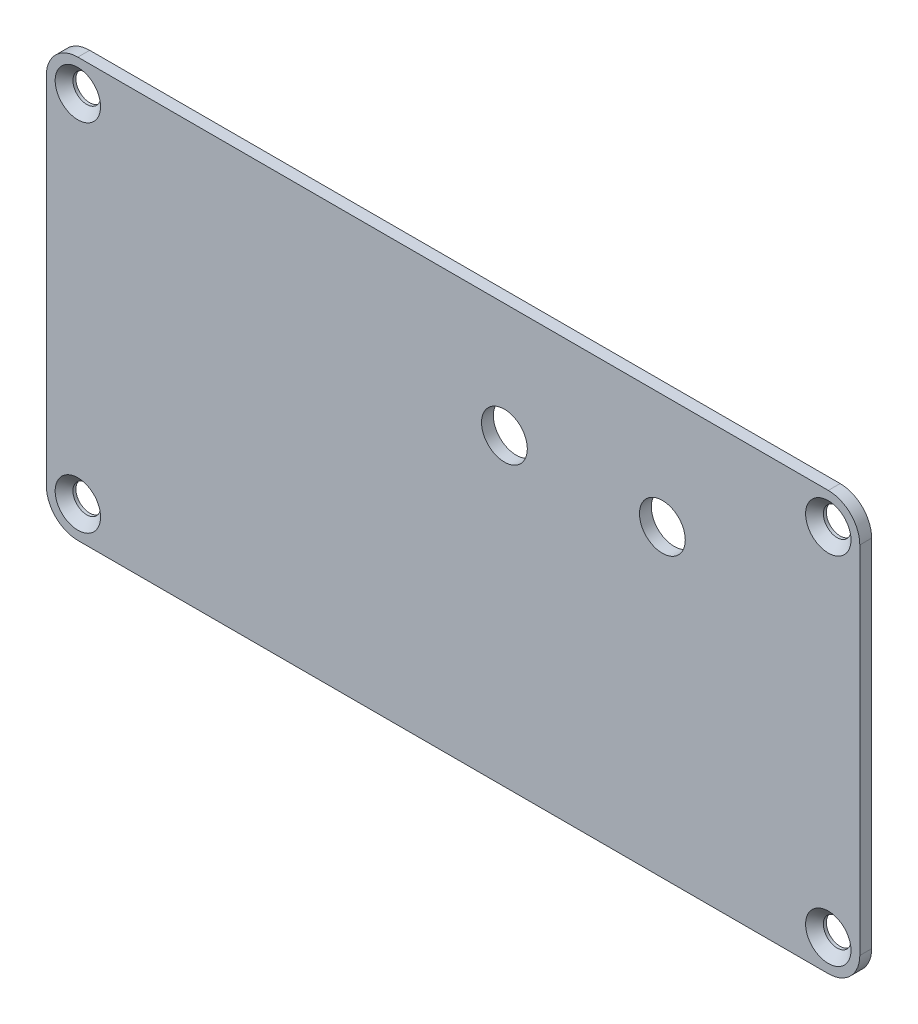
ISO-10303-21;
HEADER;
FILE_DESCRIPTION(('STEP AP214'),'2;1');
FILE_NAME('part.step','',(''),(''),'','','');
FILE_SCHEMA(('AUTOMOTIVE_DESIGN { 1 0 10303 214 1 1 1 1 }'));
ENDSEC;
DATA;
#1=APPLICATION_CONTEXT('core data for automotive mechanical design processes');
#2=APPLICATION_PROTOCOL_DEFINITION('international standard','automotive_design',2000,#1);
#3=PRODUCT_CONTEXT('',#1,'mechanical');
#4=PRODUCT('Part','Part','',(#3));
#5=PRODUCT_RELATED_PRODUCT_CATEGORY('part','',(#4));
#6=PRODUCT_DEFINITION_FORMATION('','',#4);
#7=PRODUCT_DEFINITION_CONTEXT('part definition',#1,'design');
#8=PRODUCT_DEFINITION('design','',#6,#7);
#9=PRODUCT_DEFINITION_SHAPE('','',#8);
#10=(LENGTH_UNIT() NAMED_UNIT(*) SI_UNIT(.MILLI.,.METRE.));
#11=(NAMED_UNIT(*) PLANE_ANGLE_UNIT() SI_UNIT($,.RADIAN.));
#12=(NAMED_UNIT(*) SI_UNIT($,.STERADIAN.) SOLID_ANGLE_UNIT());
#13=UNCERTAINTY_MEASURE_WITH_UNIT(LENGTH_MEASURE(1.E-05),#10,'distance_accuracy_value','');
#14=(GEOMETRIC_REPRESENTATION_CONTEXT(3) GLOBAL_UNCERTAINTY_ASSIGNED_CONTEXT((#13)) GLOBAL_UNIT_ASSIGNED_CONTEXT((#10,
#11,#12)) REPRESENTATION_CONTEXT('',''));
#15=CARTESIAN_POINT('',(0.,0.,0.));
#16=DIRECTION('',(0.,0.,1.));
#17=DIRECTION('',(1.,0.,0.));
#18=AXIS2_PLACEMENT_3D('',#15,#16,#17);
#19=CARTESIAN_POINT('',(51.5,26.5,0.750000000000008));
#20=DIRECTION('',(1.,0.,0.));
#21=DIRECTION('',(0.,0.,-1.));
#22=AXIS2_PLACEMENT_3D('',#19,#20,#21);
#23=PLANE('',#22);
#24=DIRECTION('',(0.,-1.,0.));
#25=VECTOR('',#24,1.);
#26=CARTESIAN_POINT('',(51.5,26.5,-0.749999999999994));
#27=LINE('',#26,#25);
#28=CARTESIAN_POINT('',(51.5,22.51,-0.749999999999994));
#29=VERTEX_POINT('',#28);
#30=CARTESIAN_POINT('',(51.5,-22.51,-0.749999999999994));
#31=VERTEX_POINT('',#30);
#32=EDGE_CURVE('E168',#29,#31,#27,.T.);
#33=ORIENTED_EDGE('',*,*,#32,.F.);
#34=DIRECTION('',(0.,0.,-1.));
#35=VECTOR('',#34,1.);
#36=CARTESIAN_POINT('',(51.5,22.51,0.750000000000008));
#37=LINE('',#36,#35);
#38=CARTESIAN_POINT('',(51.5,22.51,0.750000000000008));
#39=VERTEX_POINT('',#38);
#40=EDGE_CURVE('E143',#29,#39,#37,.F.);
#41=ORIENTED_EDGE('',*,*,#40,.T.);
#42=DIRECTION('',(0.,-1.,0.));
#43=VECTOR('',#42,1.);
#44=CARTESIAN_POINT('',(51.5,26.5,0.750000000000008));
#45=LINE('',#44,#43);
#46=CARTESIAN_POINT('',(51.5,-22.51,0.750000000000001));
#47=VERTEX_POINT('',#46);
#48=EDGE_CURVE('E124',#39,#47,#45,.T.);
#49=ORIENTED_EDGE('',*,*,#48,.T.);
#50=DIRECTION('',(0.,0.,-1.));
#51=VECTOR('',#50,1.);
#52=CARTESIAN_POINT('',(51.5,-22.51,0.750000000000001));
#53=LINE('',#52,#51);
#54=EDGE_CURVE('E140',#47,#31,#53,.T.);
#55=ORIENTED_EDGE('',*,*,#54,.T.);
#56=EDGE_LOOP('',(#33,#41,#49,#55));
#57=FACE_BOUND('',#56,.T.);
#58=ADVANCED_FACE('F37',(#57),#23,.T.);
#59=CARTESIAN_POINT('',(-51.5,26.5,0.750000000000008));
#60=DIRECTION('',(0.,1.,0.));
#61=DIRECTION('',(0.,0.,1.));
#62=AXIS2_PLACEMENT_3D('',#59,#60,#61);
#63=PLANE('',#62);
#64=DIRECTION('',(1.,0.,0.));
#65=VECTOR('',#64,1.);
#66=CARTESIAN_POINT('',(-51.5,26.5,0.750000000000008));
#67=LINE('',#66,#65);
#68=CARTESIAN_POINT('',(-47.51,26.5,0.750000000000008));
#69=VERTEX_POINT('',#68);
#70=CARTESIAN_POINT('',(47.51,26.5,0.750000000000008));
#71=VERTEX_POINT('',#70);
#72=EDGE_CURVE('E129',#69,#71,#67,.T.);
#73=ORIENTED_EDGE('',*,*,#72,.T.);
#74=DIRECTION('',(0.,0.,-1.));
#75=VECTOR('',#74,1.);
#76=CARTESIAN_POINT('',(47.51,26.5,0.750000000000008));
#77=LINE('',#76,#75);
#78=CARTESIAN_POINT('',(47.51,26.5,-0.749999999999994));
#79=VERTEX_POINT('',#78);
#80=EDGE_CURVE('E123',#71,#79,#77,.T.);
#81=ORIENTED_EDGE('',*,*,#80,.T.);
#82=DIRECTION('',(1.,0.,0.));
#83=VECTOR('',#82,1.);
#84=CARTESIAN_POINT('',(-51.5,26.5,-0.749999999999994));
#85=LINE('',#84,#83);
#86=CARTESIAN_POINT('',(-47.51,26.5,-0.749999999999994));
#87=VERTEX_POINT('',#86);
#88=EDGE_CURVE('E107',#87,#79,#85,.T.);
#89=ORIENTED_EDGE('',*,*,#88,.F.);
#90=DIRECTION('',(0.,0.,-1.));
#91=VECTOR('',#90,1.);
#92=CARTESIAN_POINT('',(-47.51,26.5,0.750000000000008));
#93=LINE('',#92,#91);
#94=EDGE_CURVE('E120',#87,#69,#93,.F.);
#95=ORIENTED_EDGE('',*,*,#94,.T.);
#96=EDGE_LOOP('',(#73,#81,#89,#95));
#97=FACE_BOUND('',#96,.T.);
#98=ADVANCED_FACE('F119',(#97),#63,.T.);
#99=CARTESIAN_POINT('',(-51.5,-26.5,0.750000000000001));
#100=DIRECTION('',(-1.,0.,0.));
#101=DIRECTION('',(0.,0.,1.));
#102=AXIS2_PLACEMENT_3D('',#99,#100,#101);
#103=PLANE('',#102);
#104=DIRECTION('',(0.,1.,0.));
#105=VECTOR('',#104,1.);
#106=CARTESIAN_POINT('',(-51.5,-26.5,0.750000000000001));
#107=LINE('',#106,#105);
#108=CARTESIAN_POINT('',(-51.5,-22.51,0.750000000000001));
#109=VERTEX_POINT('',#108);
#110=CARTESIAN_POINT('',(-51.5,22.51,0.750000000000008));
#111=VERTEX_POINT('',#110);
#112=EDGE_CURVE('E132',#109,#111,#107,.T.);
#113=ORIENTED_EDGE('',*,*,#112,.T.);
#114=DIRECTION('',(0.,0.,-1.));
#115=VECTOR('',#114,1.);
#116=CARTESIAN_POINT('',(-51.5,22.51,0.750000000000008));
#117=LINE('',#116,#115);
#118=CARTESIAN_POINT('',(-51.5,22.51,-0.749999999999994));
#119=VERTEX_POINT('',#118);
#120=EDGE_CURVE('E11',#111,#119,#117,.T.);
#121=ORIENTED_EDGE('',*,*,#120,.T.);
#122=DIRECTION('',(0.,1.,0.));
#123=VECTOR('',#122,1.);
#124=CARTESIAN_POINT('',(-51.5,-26.5,-0.749999999999994));
#125=LINE('',#124,#123);
#126=CARTESIAN_POINT('',(-51.5,-22.51,-0.749999999999994));
#127=VERTEX_POINT('',#126);
#128=EDGE_CURVE('E109',#127,#119,#125,.T.);
#129=ORIENTED_EDGE('',*,*,#128,.F.);
#130=DIRECTION('',(0.,0.,-1.));
#131=VECTOR('',#130,1.);
#132=CARTESIAN_POINT('',(-51.5,-22.51,0.750000000000001));
#133=LINE('',#132,#131);
#134=EDGE_CURVE('E45',#127,#109,#133,.F.);
#135=ORIENTED_EDGE('',*,*,#134,.T.);
#136=EDGE_LOOP('',(#113,#121,#129,#135));
#137=FACE_BOUND('',#136,.T.);
#138=ADVANCED_FACE('F157',(#137),#103,.T.);
#139=CARTESIAN_POINT('',(51.5,-26.5,0.750000000000001));
#140=DIRECTION('',(0.,-1.,0.));
#141=DIRECTION('',(0.,0.,-1.));
#142=AXIS2_PLACEMENT_3D('',#139,#140,#141);
#143=PLANE('',#142);
#144=DIRECTION('',(-1.,0.,0.));
#145=VECTOR('',#144,1.);
#146=CARTESIAN_POINT('',(51.5,-26.5,-0.749999999999994));
#147=LINE('',#146,#145);
#148=CARTESIAN_POINT('',(47.51,-26.5,-0.749999999999994));
#149=VERTEX_POINT('',#148);
#150=CARTESIAN_POINT('',(-47.51,-26.5,-0.749999999999994));
#151=VERTEX_POINT('',#150);
#152=EDGE_CURVE('E166',#149,#151,#147,.T.);
#153=ORIENTED_EDGE('',*,*,#152,.F.);
#154=DIRECTION('',(0.,0.,-1.));
#155=VECTOR('',#154,1.);
#156=CARTESIAN_POINT('',(47.51,-26.5,0.750000000000001));
#157=LINE('',#156,#155);
#158=CARTESIAN_POINT('',(47.51,-26.5,0.750000000000001));
#159=VERTEX_POINT('',#158);
#160=EDGE_CURVE('E59',#149,#159,#157,.F.);
#161=ORIENTED_EDGE('',*,*,#160,.T.);
#162=DIRECTION('',(-1.,0.,0.));
#163=VECTOR('',#162,1.);
#164=CARTESIAN_POINT('',(51.5,-26.5,0.750000000000001));
#165=LINE('',#164,#163);
#166=CARTESIAN_POINT('',(-47.51,-26.5,0.750000000000001));
#167=VERTEX_POINT('',#166);
#168=EDGE_CURVE('E161',#159,#167,#165,.T.);
#169=ORIENTED_EDGE('',*,*,#168,.T.);
#170=DIRECTION('',(0.,0.,-1.));
#171=VECTOR('',#170,1.);
#172=CARTESIAN_POINT('',(-47.51,-26.5,0.750000000000001));
#173=LINE('',#172,#171);
#174=EDGE_CURVE('E151',#167,#151,#173,.T.);
#175=ORIENTED_EDGE('',*,*,#174,.T.);
#176=EDGE_LOOP('',(#153,#161,#169,#175));
#177=FACE_BOUND('',#176,.T.);
#178=ADVANCED_FACE('F165',(#177),#143,.T.);
#179=CARTESIAN_POINT('',(0.,0.,0.750000000000001));
#180=DIRECTION('',(0.,0.,-1.));
#181=DIRECTION('',(-1.,0.,0.));
#182=AXIS2_PLACEMENT_3D('',#179,#180,#181);
#183=PLANE('',#182);
#184=CARTESIAN_POINT('',(6.50000000000001,12.,0.750000000000001));
#185=DIRECTION('',(0.,0.,1.));
#186=DIRECTION('',(1.,0.,0.));
#187=AXIS2_PLACEMENT_3D('',#184,#185,#186);
#188=CIRCLE('',#187,2.9);
#189=CARTESIAN_POINT('',(9.40000000000001,12.,0.750000000000001));
#190=VERTEX_POINT('',#189);
#191=EDGE_CURVE('E218',#190,#190,#188,.T.);
#192=ORIENTED_EDGE('',*,*,#191,.F.);
#193=EDGE_LOOP('',(#192));
#194=FACE_BOUND('',#193,.T.);
#195=CARTESIAN_POINT('',(26.5,12.,0.750000000000001));
#196=DIRECTION('',(0.,0.,1.));
#197=DIRECTION('',(1.,0.,0.));
#198=AXIS2_PLACEMENT_3D('',#195,#196,#197);
#199=CIRCLE('',#198,2.9);
#200=CARTESIAN_POINT('',(29.4,12.,0.750000000000001));
#201=VERTEX_POINT('',#200);
#202=EDGE_CURVE('E212',#201,#201,#199,.T.);
#203=ORIENTED_EDGE('',*,*,#202,.F.);
#204=EDGE_LOOP('',(#203));
#205=FACE_BOUND('',#204,.T.);
#206=CARTESIAN_POINT('',(-47.51,22.5,0.750000000000008));
#207=DIRECTION('',(0.,0.,1.));
#208=DIRECTION('',(1.,0.,0.));
#209=AXIS2_PLACEMENT_3D('',#206,#207,#208);
#210=CIRCLE('',#209,2.87499999999999);
#211=CARTESIAN_POINT('',(-44.635,22.5,0.750000000000008));
#212=VERTEX_POINT('',#211);
#213=EDGE_CURVE('E208',#212,#212,#210,.T.);
#214=ORIENTED_EDGE('',*,*,#213,.F.);
#215=EDGE_LOOP('',(#214));
#216=FACE_BOUND('',#215,.T.);
#217=CARTESIAN_POINT('',(47.51,22.5,0.750000000000008));
#218=DIRECTION('',(0.,0.,1.));
#219=DIRECTION('',(1.,0.,0.));
#220=AXIS2_PLACEMENT_3D('',#217,#218,#219);
#221=CIRCLE('',#220,2.87499999999999);
#222=CARTESIAN_POINT('',(50.385,22.5,0.750000000000008));
#223=VERTEX_POINT('',#222);
#224=EDGE_CURVE('E199',#223,#223,#221,.T.);
#225=ORIENTED_EDGE('',*,*,#224,.F.);
#226=EDGE_LOOP('',(#225));
#227=FACE_BOUND('',#226,.T.);
#228=CARTESIAN_POINT('',(47.51,-22.5,0.750000000000008));
#229=DIRECTION('',(0.,0.,1.));
#230=DIRECTION('',(1.,0.,0.));
#231=AXIS2_PLACEMENT_3D('',#228,#229,#230);
#232=CIRCLE('',#231,2.87499999999999);
#233=CARTESIAN_POINT('',(50.385,-22.5,0.750000000000008));
#234=VERTEX_POINT('',#233);
#235=EDGE_CURVE('E190',#234,#234,#232,.T.);
#236=ORIENTED_EDGE('',*,*,#235,.F.);
#237=EDGE_LOOP('',(#236));
#238=FACE_BOUND('',#237,.T.);
#239=CARTESIAN_POINT('',(-47.51,-22.5,0.750000000000008));
#240=DIRECTION('',(0.,0.,1.));
#241=DIRECTION('',(1.,0.,0.));
#242=AXIS2_PLACEMENT_3D('',#239,#240,#241);
#243=CIRCLE('',#242,2.87499999999999);
#244=CARTESIAN_POINT('',(-44.635,-22.5,0.750000000000008));
#245=VERTEX_POINT('',#244);
#246=EDGE_CURVE('E181',#245,#245,#243,.T.);
#247=ORIENTED_EDGE('',*,*,#246,.F.);
#248=EDGE_LOOP('',(#247));
#249=FACE_BOUND('',#248,.T.);
#250=ORIENTED_EDGE('',*,*,#48,.F.);
#251=CARTESIAN_POINT('',(47.51,22.51,0.750000000000008));
#252=DIRECTION('',(0.,0.,-1.));
#253=DIRECTION('',(-1.,0.,0.));
#254=AXIS2_PLACEMENT_3D('',#251,#252,#253);
#255=CIRCLE('',#254,3.99);
#256=EDGE_CURVE('E149',#39,#71,#255,.F.);
#257=ORIENTED_EDGE('',*,*,#256,.T.);
#258=ORIENTED_EDGE('',*,*,#72,.F.);
#259=CARTESIAN_POINT('',(-47.51,22.51,0.750000000000008));
#260=DIRECTION('',(0.,0.,-1.));
#261=DIRECTION('',(-1.,0.,0.));
#262=AXIS2_PLACEMENT_3D('',#259,#260,#261);
#263=CIRCLE('',#262,3.99);
#264=EDGE_CURVE('E128',#69,#111,#263,.F.);
#265=ORIENTED_EDGE('',*,*,#264,.T.);
#266=ORIENTED_EDGE('',*,*,#112,.F.);
#267=CARTESIAN_POINT('',(-47.51,-22.51,0.750000000000001));
#268=DIRECTION('',(0.,0.,-1.));
#269=DIRECTION('',(-1.,0.,0.));
#270=AXIS2_PLACEMENT_3D('',#267,#268,#269);
#271=CIRCLE('',#270,3.99);
#272=EDGE_CURVE('E52',#109,#167,#271,.F.);
#273=ORIENTED_EDGE('',*,*,#272,.T.);
#274=ORIENTED_EDGE('',*,*,#168,.F.);
#275=CARTESIAN_POINT('',(47.51,-22.51,0.750000000000001));
#276=DIRECTION('',(0.,0.,-1.));
#277=DIRECTION('',(-1.,0.,0.));
#278=AXIS2_PLACEMENT_3D('',#275,#276,#277);
#279=CIRCLE('',#278,3.99);
#280=EDGE_CURVE('E147',#159,#47,#279,.F.);
#281=ORIENTED_EDGE('',*,*,#280,.T.);
#282=EDGE_LOOP('',(#250,#257,#258,#265,#266,#273,#274,#281));
#283=FACE_BOUND('',#282,.T.);
#284=ADVANCED_FACE('F160',(#194,#205,#216,#227,#238,#249,#283),#183,.F.);
#285=CARTESIAN_POINT('',(0.,0.,-0.750000000000001));
#286=DIRECTION('',(0.,0.,-1.));
#287=DIRECTION('',(-1.,0.,0.));
#288=AXIS2_PLACEMENT_3D('',#285,#286,#287);
#289=PLANE('',#288);
#290=CARTESIAN_POINT('',(6.50000000000001,12.,-0.750000000000001));
#291=DIRECTION('',(0.,0.,1.));
#292=DIRECTION('',(1.,0.,0.));
#293=AXIS2_PLACEMENT_3D('',#290,#291,#292);
#294=CIRCLE('',#293,2.9);
#295=CARTESIAN_POINT('',(9.40000000000001,12.,-0.750000000000001));
#296=VERTEX_POINT('',#295);
#297=EDGE_CURVE('E215',#296,#296,#294,.T.);
#298=ORIENTED_EDGE('',*,*,#297,.T.);
#299=EDGE_LOOP('',(#298));
#300=FACE_BOUND('',#299,.T.);
#301=CARTESIAN_POINT('',(26.5,12.,-0.750000000000001));
#302=DIRECTION('',(0.,0.,1.));
#303=DIRECTION('',(1.,0.,0.));
#304=AXIS2_PLACEMENT_3D('',#301,#302,#303);
#305=CIRCLE('',#304,2.9);
#306=CARTESIAN_POINT('',(29.4,12.,-0.750000000000001));
#307=VERTEX_POINT('',#306);
#308=EDGE_CURVE('E211',#307,#307,#305,.T.);
#309=ORIENTED_EDGE('',*,*,#308,.T.);
#310=EDGE_LOOP('',(#309));
#311=FACE_BOUND('',#310,.T.);
#312=CARTESIAN_POINT('',(-47.51,22.5,-0.749999999999994));
#313=DIRECTION('',(0.,0.,1.));
#314=DIRECTION('',(1.,0.,0.));
#315=AXIS2_PLACEMENT_3D('',#312,#313,#314);
#316=CIRCLE('',#315,1.74999999999999);
#317=CARTESIAN_POINT('',(-45.76,22.5,-0.749999999999994));
#318=VERTEX_POINT('',#317);
#319=EDGE_CURVE('E202',#318,#318,#316,.T.);
#320=ORIENTED_EDGE('',*,*,#319,.T.);
#321=EDGE_LOOP('',(#320));
#322=FACE_BOUND('',#321,.T.);
#323=CARTESIAN_POINT('',(47.51,22.5,-0.749999999999994));
#324=DIRECTION('',(0.,0.,1.));
#325=DIRECTION('',(1.,0.,0.));
#326=AXIS2_PLACEMENT_3D('',#323,#324,#325);
#327=CIRCLE('',#326,1.74999999999999);
#328=CARTESIAN_POINT('',(49.26,22.5,-0.749999999999994));
#329=VERTEX_POINT('',#328);
#330=EDGE_CURVE('E193',#329,#329,#327,.T.);
#331=ORIENTED_EDGE('',*,*,#330,.T.);
#332=EDGE_LOOP('',(#331));
#333=FACE_BOUND('',#332,.T.);
#334=CARTESIAN_POINT('',(47.51,-22.5,-0.750000000000001));
#335=DIRECTION('',(0.,0.,1.));
#336=DIRECTION('',(1.,0.,0.));
#337=AXIS2_PLACEMENT_3D('',#334,#335,#336);
#338=CIRCLE('',#337,1.74999999999999);
#339=CARTESIAN_POINT('',(49.26,-22.5,-0.750000000000001));
#340=VERTEX_POINT('',#339);
#341=EDGE_CURVE('E184',#340,#340,#338,.T.);
#342=ORIENTED_EDGE('',*,*,#341,.T.);
#343=EDGE_LOOP('',(#342));
#344=FACE_BOUND('',#343,.T.);
#345=CARTESIAN_POINT('',(-47.51,-22.5,-0.750000000000001));
#346=DIRECTION('',(0.,0.,1.));
#347=DIRECTION('',(1.,0.,0.));
#348=AXIS2_PLACEMENT_3D('',#345,#346,#347);
#349=CIRCLE('',#348,1.74999999999999);
#350=CARTESIAN_POINT('',(-45.76,-22.5,-0.750000000000001));
#351=VERTEX_POINT('',#350);
#352=EDGE_CURVE('E170',#351,#351,#349,.T.);
#353=ORIENTED_EDGE('',*,*,#352,.T.);
#354=EDGE_LOOP('',(#353));
#355=FACE_BOUND('',#354,.T.);
#356=ORIENTED_EDGE('',*,*,#88,.T.);
#357=CARTESIAN_POINT('',(47.51,22.51,-0.749999999999994));
#358=DIRECTION('',(0.,0.,-1.));
#359=DIRECTION('',(-1.,0.,0.));
#360=AXIS2_PLACEMENT_3D('',#357,#358,#359);
#361=CIRCLE('',#360,3.99);
#362=EDGE_CURVE('E138',#79,#29,#361,.T.);
#363=ORIENTED_EDGE('',*,*,#362,.T.);
#364=ORIENTED_EDGE('',*,*,#32,.T.);
#365=CARTESIAN_POINT('',(47.51,-22.51,-0.749999999999994));
#366=DIRECTION('',(0.,0.,-1.));
#367=DIRECTION('',(-1.,0.,0.));
#368=AXIS2_PLACEMENT_3D('',#365,#366,#367);
#369=CIRCLE('',#368,3.99);
#370=EDGE_CURVE('E113',#31,#149,#369,.T.);
#371=ORIENTED_EDGE('',*,*,#370,.T.);
#372=ORIENTED_EDGE('',*,*,#152,.T.);
#373=CARTESIAN_POINT('',(-47.51,-22.51,-0.749999999999994));
#374=DIRECTION('',(0.,0.,-1.));
#375=DIRECTION('',(-1.,0.,0.));
#376=AXIS2_PLACEMENT_3D('',#373,#374,#375);
#377=CIRCLE('',#376,3.99);
#378=EDGE_CURVE('E114',#151,#127,#377,.T.);
#379=ORIENTED_EDGE('',*,*,#378,.T.);
#380=ORIENTED_EDGE('',*,*,#128,.T.);
#381=CARTESIAN_POINT('',(-47.51,22.51,-0.749999999999994));
#382=DIRECTION('',(0.,0.,-1.));
#383=DIRECTION('',(-1.,0.,0.));
#384=AXIS2_PLACEMENT_3D('',#381,#382,#383);
#385=CIRCLE('',#384,3.99);
#386=EDGE_CURVE('E104',#119,#87,#385,.T.);
#387=ORIENTED_EDGE('',*,*,#386,.T.);
#388=EDGE_LOOP('',(#356,#363,#364,#371,#372,#379,#380,#387));
#389=FACE_BOUND('',#388,.T.);
#390=ADVANCED_FACE('F106',(#300,#311,#322,#333,#344,#355,#389),#289,.T.);
#391=CARTESIAN_POINT('',(-47.51,-22.5,0.750000000000001));
#392=DIRECTION('',(0.,0.,1.));
#393=DIRECTION('',(1.,0.,0.));
#394=AXIS2_PLACEMENT_3D('',#391,#392,#393);
#395=CYLINDRICAL_SURFACE('',#394,1.74999999999999);
#396=ORIENTED_EDGE('',*,*,#352,.F.);
#397=EDGE_LOOP('',(#396));
#398=FACE_BOUND('',#397,.T.);
#399=CARTESIAN_POINT('',(-47.51,-22.5,-0.375000000000014));
#400=DIRECTION('',(0.,0.,1.));
#401=DIRECTION('',(1.,0.,0.));
#402=AXIS2_PLACEMENT_3D('',#399,#400,#401);
#403=CIRCLE('',#402,1.74999999999999);
#404=CARTESIAN_POINT('',(-45.76,-22.5,-0.375000000000014));
#405=VERTEX_POINT('',#404);
#406=EDGE_CURVE('E178',#405,#405,#403,.T.);
#407=ORIENTED_EDGE('',*,*,#406,.T.);
#408=EDGE_LOOP('',(#407));
#409=FACE_BOUND('',#408,.T.);
#410=ADVANCED_FACE('F249',(#398,#409),#395,.F.);
#411=CARTESIAN_POINT('',(-47.51,-22.5,0.750000000000008));
#412=DIRECTION('',(0.,0.,1.));
#413=DIRECTION('',(1.,0.,0.));
#414=AXIS2_PLACEMENT_3D('',#411,#412,#413);
#415=CONICAL_SURFACE('',#414,2.87499999999999,0.785398163397442);
#416=ORIENTED_EDGE('',*,*,#406,.F.);
#417=EDGE_LOOP('',(#416));
#418=FACE_BOUND('',#417,.T.);
#419=ORIENTED_EDGE('',*,*,#246,.T.);
#420=EDGE_LOOP('',(#419));
#421=FACE_BOUND('',#420,.T.);
#422=ADVANCED_FACE('F246',(#418,#421),#415,.F.);
#423=CARTESIAN_POINT('',(47.51,-22.5,0.750000000000001));
#424=DIRECTION('',(0.,0.,1.));
#425=DIRECTION('',(1.,0.,0.));
#426=AXIS2_PLACEMENT_3D('',#423,#424,#425);
#427=CYLINDRICAL_SURFACE('',#426,1.74999999999999);
#428=ORIENTED_EDGE('',*,*,#341,.F.);
#429=EDGE_LOOP('',(#428));
#430=FACE_BOUND('',#429,.T.);
#431=CARTESIAN_POINT('',(47.51,-22.5,-0.375000000000014));
#432=DIRECTION('',(0.,0.,1.));
#433=DIRECTION('',(1.,0.,0.));
#434=AXIS2_PLACEMENT_3D('',#431,#432,#433);
#435=CIRCLE('',#434,1.74999999999999);
#436=CARTESIAN_POINT('',(49.26,-22.5,-0.375000000000014));
#437=VERTEX_POINT('',#436);
#438=EDGE_CURVE('E187',#437,#437,#435,.T.);
#439=ORIENTED_EDGE('',*,*,#438,.T.);
#440=EDGE_LOOP('',(#439));
#441=FACE_BOUND('',#440,.T.);
#442=ADVANCED_FACE('F248',(#430,#441),#427,.F.);
#443=CARTESIAN_POINT('',(47.51,-22.5,0.750000000000008));
#444=DIRECTION('',(0.,0.,1.));
#445=DIRECTION('',(1.,0.,0.));
#446=AXIS2_PLACEMENT_3D('',#443,#444,#445);
#447=CONICAL_SURFACE('',#446,2.87499999999999,0.785398163397442);
#448=ORIENTED_EDGE('',*,*,#438,.F.);
#449=EDGE_LOOP('',(#448));
#450=FACE_BOUND('',#449,.T.);
#451=ORIENTED_EDGE('',*,*,#235,.T.);
#452=EDGE_LOOP('',(#451));
#453=FACE_BOUND('',#452,.T.);
#454=ADVANCED_FACE('F256',(#450,#453),#447,.F.);
#455=CARTESIAN_POINT('',(47.51,22.5,0.750000000000008));
#456=DIRECTION('',(0.,0.,1.));
#457=DIRECTION('',(1.,0.,0.));
#458=AXIS2_PLACEMENT_3D('',#455,#456,#457);
#459=CYLINDRICAL_SURFACE('',#458,1.74999999999999);
#460=ORIENTED_EDGE('',*,*,#330,.F.);
#461=EDGE_LOOP('',(#460));
#462=FACE_BOUND('',#461,.T.);
#463=CARTESIAN_POINT('',(47.51,22.5,-0.375000000000007));
#464=DIRECTION('',(0.,0.,1.));
#465=DIRECTION('',(1.,0.,0.));
#466=AXIS2_PLACEMENT_3D('',#463,#464,#465);
#467=CIRCLE('',#466,1.74999999999999);
#468=CARTESIAN_POINT('',(49.26,22.5,-0.375000000000007));
#469=VERTEX_POINT('',#468);
#470=EDGE_CURVE('E196',#469,#469,#467,.T.);
#471=ORIENTED_EDGE('',*,*,#470,.T.);
#472=EDGE_LOOP('',(#471));
#473=FACE_BOUND('',#472,.T.);
#474=ADVANCED_FACE('F305',(#462,#473),#459,.F.);
#475=CARTESIAN_POINT('',(47.51,22.5,0.750000000000008));
#476=DIRECTION('',(0.,0.,1.));
#477=DIRECTION('',(1.,0.,0.));
#478=AXIS2_PLACEMENT_3D('',#475,#476,#477);
#479=CONICAL_SURFACE('',#478,2.87499999999999,0.785398163397442);
#480=ORIENTED_EDGE('',*,*,#470,.F.);
#481=EDGE_LOOP('',(#480));
#482=FACE_BOUND('',#481,.T.);
#483=ORIENTED_EDGE('',*,*,#224,.T.);
#484=EDGE_LOOP('',(#483));
#485=FACE_BOUND('',#484,.T.);
#486=ADVANCED_FACE('F301',(#482,#485),#479,.F.);
#487=CARTESIAN_POINT('',(-47.51,22.5,0.750000000000008));
#488=DIRECTION('',(0.,0.,1.));
#489=DIRECTION('',(1.,0.,0.));
#490=AXIS2_PLACEMENT_3D('',#487,#488,#489);
#491=CYLINDRICAL_SURFACE('',#490,1.74999999999999);
#492=ORIENTED_EDGE('',*,*,#319,.F.);
#493=EDGE_LOOP('',(#492));
#494=FACE_BOUND('',#493,.T.);
#495=CARTESIAN_POINT('',(-47.51,22.5,-0.375000000000007));
#496=DIRECTION('',(0.,0.,1.));
#497=DIRECTION('',(1.,0.,0.));
#498=AXIS2_PLACEMENT_3D('',#495,#496,#497);
#499=CIRCLE('',#498,1.74999999999999);
#500=CARTESIAN_POINT('',(-45.76,22.5,-0.375000000000007));
#501=VERTEX_POINT('',#500);
#502=EDGE_CURVE('E205',#501,#501,#499,.T.);
#503=ORIENTED_EDGE('',*,*,#502,.T.);
#504=EDGE_LOOP('',(#503));
#505=FACE_BOUND('',#504,.T.);
#506=ADVANCED_FACE('F297',(#494,#505),#491,.F.);
#507=CARTESIAN_POINT('',(-47.51,22.5,0.750000000000008));
#508=DIRECTION('',(0.,0.,1.));
#509=DIRECTION('',(1.,0.,0.));
#510=AXIS2_PLACEMENT_3D('',#507,#508,#509);
#511=CONICAL_SURFACE('',#510,2.87499999999999,0.785398163397442);
#512=ORIENTED_EDGE('',*,*,#502,.F.);
#513=EDGE_LOOP('',(#512));
#514=FACE_BOUND('',#513,.T.);
#515=ORIENTED_EDGE('',*,*,#213,.T.);
#516=EDGE_LOOP('',(#515));
#517=FACE_BOUND('',#516,.T.);
#518=ADVANCED_FACE('F277',(#514,#517),#511,.F.);
#519=CARTESIAN_POINT('',(47.51,22.51,0.750000000000008));
#520=DIRECTION('',(0.,0.,-1.));
#521=DIRECTION('',(-1.,0.,0.));
#522=AXIS2_PLACEMENT_3D('',#519,#520,#521);
#523=CYLINDRICAL_SURFACE('',#522,3.99);
#524=ORIENTED_EDGE('',*,*,#256,.F.);
#525=ORIENTED_EDGE('',*,*,#40,.F.);
#526=ORIENTED_EDGE('',*,*,#362,.F.);
#527=ORIENTED_EDGE('',*,*,#80,.F.);
#528=EDGE_LOOP('',(#524,#525,#526,#527));
#529=FACE_BOUND('',#528,.T.);
#530=ADVANCED_FACE('F273',(#529),#523,.T.);
#531=CARTESIAN_POINT('',(47.51,-22.51,0.750000000000001));
#532=DIRECTION('',(0.,0.,-1.));
#533=DIRECTION('',(-1.,0.,0.));
#534=AXIS2_PLACEMENT_3D('',#531,#532,#533);
#535=CYLINDRICAL_SURFACE('',#534,3.99);
#536=ORIENTED_EDGE('',*,*,#280,.F.);
#537=ORIENTED_EDGE('',*,*,#160,.F.);
#538=ORIENTED_EDGE('',*,*,#370,.F.);
#539=ORIENTED_EDGE('',*,*,#54,.F.);
#540=EDGE_LOOP('',(#536,#537,#538,#539));
#541=FACE_BOUND('',#540,.T.);
#542=ADVANCED_FACE('F276',(#541),#535,.T.);
#543=CARTESIAN_POINT('',(-47.51,22.51,0.750000000000008));
#544=DIRECTION('',(0.,0.,-1.));
#545=DIRECTION('',(-1.,0.,0.));
#546=AXIS2_PLACEMENT_3D('',#543,#544,#545);
#547=CYLINDRICAL_SURFACE('',#546,3.99);
#548=ORIENTED_EDGE('',*,*,#264,.F.);
#549=ORIENTED_EDGE('',*,*,#94,.F.);
#550=ORIENTED_EDGE('',*,*,#386,.F.);
#551=ORIENTED_EDGE('',*,*,#120,.F.);
#552=EDGE_LOOP('',(#548,#549,#550,#551));
#553=FACE_BOUND('',#552,.T.);
#554=ADVANCED_FACE('F127',(#553),#547,.T.);
#555=CARTESIAN_POINT('',(-47.51,-22.51,0.750000000000001));
#556=DIRECTION('',(0.,0.,-1.));
#557=DIRECTION('',(-1.,0.,0.));
#558=AXIS2_PLACEMENT_3D('',#555,#556,#557);
#559=CYLINDRICAL_SURFACE('',#558,3.99);
#560=ORIENTED_EDGE('',*,*,#272,.F.);
#561=ORIENTED_EDGE('',*,*,#134,.F.);
#562=ORIENTED_EDGE('',*,*,#378,.F.);
#563=ORIENTED_EDGE('',*,*,#174,.F.);
#564=EDGE_LOOP('',(#560,#561,#562,#563));
#565=FACE_BOUND('',#564,.T.);
#566=ADVANCED_FACE('F39',(#565),#559,.T.);
#567=CARTESIAN_POINT('',(26.5,12.,-0.750000000000001));
#568=DIRECTION('',(0.,0.,1.));
#569=DIRECTION('',(1.,0.,0.));
#570=AXIS2_PLACEMENT_3D('',#567,#568,#569);
#571=CYLINDRICAL_SURFACE('',#570,2.9);
#572=ORIENTED_EDGE('',*,*,#308,.F.);
#573=EDGE_LOOP('',(#572));
#574=FACE_BOUND('',#573,.T.);
#575=ORIENTED_EDGE('',*,*,#202,.T.);
#576=EDGE_LOOP('',(#575));
#577=FACE_BOUND('',#576,.T.);
#578=ADVANCED_FACE('F229',(#574,#577),#571,.F.);
#579=CARTESIAN_POINT('',(6.50000000000001,12.,-0.750000000000001));
#580=DIRECTION('',(0.,0.,1.));
#581=DIRECTION('',(1.,0.,0.));
#582=AXIS2_PLACEMENT_3D('',#579,#580,#581);
#583=CYLINDRICAL_SURFACE('',#582,2.9);
#584=ORIENTED_EDGE('',*,*,#297,.F.);
#585=EDGE_LOOP('',(#584));
#586=FACE_BOUND('',#585,.T.);
#587=ORIENTED_EDGE('',*,*,#191,.T.);
#588=EDGE_LOOP('',(#587));
#589=FACE_BOUND('',#588,.T.);
#590=ADVANCED_FACE('F226',(#586,#589),#583,.F.);
#591=CLOSED_SHELL('',(#58,#98,#138,#178,#284,#390,#410,#422,#442,#454,#474,#486,#506,#518,#530,
#542,#554,#566,#578,#590));
#592=MANIFOLD_SOLID_BREP('B2',#591);
#593=ADVANCED_BREP_SHAPE_REPRESENTATION('',(#18,#592),#14);
#594=SHAPE_DEFINITION_REPRESENTATION(#9,#593);
ENDSEC;
END-ISO-10303-21;
